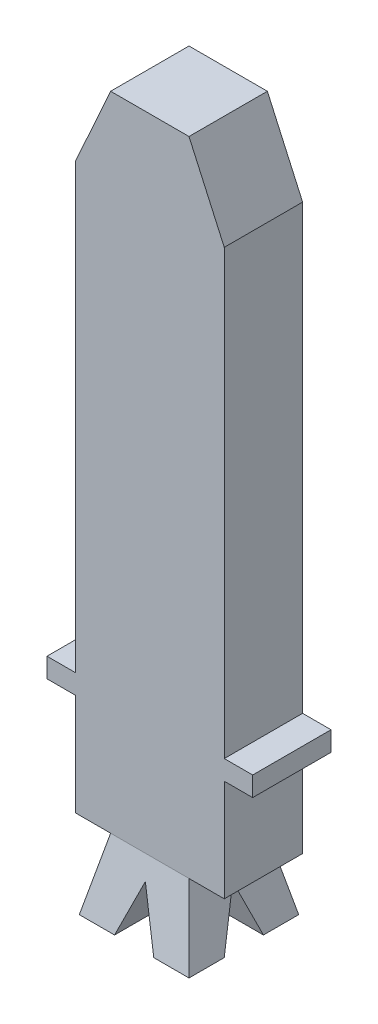
ISO-10303-21;
HEADER;
FILE_DESCRIPTION(('STEP AP214'),'2;1');
FILE_NAME('part.step','',(''),(''),'','','');
FILE_SCHEMA(('AUTOMOTIVE_DESIGN { 1 0 10303 214 1 1 1 1 }'));
ENDSEC;
DATA;
#1=APPLICATION_CONTEXT('core data for automotive mechanical design processes');
#2=APPLICATION_PROTOCOL_DEFINITION('international standard','automotive_design',2000,#1);
#3=PRODUCT_CONTEXT('',#1,'mechanical');
#4=PRODUCT('Part','Part','',(#3));
#5=PRODUCT_RELATED_PRODUCT_CATEGORY('part','',(#4));
#6=PRODUCT_DEFINITION_FORMATION('','',#4);
#7=PRODUCT_DEFINITION_CONTEXT('part definition',#1,'design');
#8=PRODUCT_DEFINITION('design','',#6,#7);
#9=PRODUCT_DEFINITION_SHAPE('','',#8);
#10=(LENGTH_UNIT() NAMED_UNIT(*) SI_UNIT(.MILLI.,.METRE.));
#11=(NAMED_UNIT(*) PLANE_ANGLE_UNIT() SI_UNIT($,.RADIAN.));
#12=(NAMED_UNIT(*) SI_UNIT($,.STERADIAN.) SOLID_ANGLE_UNIT());
#13=UNCERTAINTY_MEASURE_WITH_UNIT(LENGTH_MEASURE(1.E-05),#10,'distance_accuracy_value','');
#14=(GEOMETRIC_REPRESENTATION_CONTEXT(3) GLOBAL_UNCERTAINTY_ASSIGNED_CONTEXT((#13)) GLOBAL_UNIT_ASSIGNED_CONTEXT((#10,
#11,#12)) REPRESENTATION_CONTEXT('',''));
#15=CARTESIAN_POINT('',(0.,0.,0.));
#16=DIRECTION('',(0.,0.,1.));
#17=DIRECTION('',(1.,0.,0.));
#18=AXIS2_PLACEMENT_3D('',#15,#16,#17);
#19=CARTESIAN_POINT('',(0.,-4.9,0.));
#20=DIRECTION('',(0.,-1.,0.));
#21=DIRECTION('',(0.,0.,-1.));
#22=AXIS2_PLACEMENT_3D('',#19,#20,#21);
#23=PLANE('',#22);
#24=DIRECTION('',(-1.,0.,0.));
#25=VECTOR('',#24,1.);
#26=CARTESIAN_POINT('',(2.625,-4.9,1.5));
#27=LINE('',#26,#25);
#28=CARTESIAN_POINT('',(1.4,-4.9,1.5));
#29=VERTEX_POINT('',#28);
#30=CARTESIAN_POINT('',(0.5,-4.9,1.5));
#31=VERTEX_POINT('',#30);
#32=EDGE_CURVE('E480',#29,#31,#27,.T.);
#33=ORIENTED_EDGE('',*,*,#32,.F.);
#34=DIRECTION('',(0.,0.,1.));
#35=VECTOR('',#34,1.);
#36=CARTESIAN_POINT('',(1.4,-4.9,-0.4));
#37=LINE('',#36,#35);
#38=CARTESIAN_POINT('',(1.4,-4.9,2.4));
#39=VERTEX_POINT('',#38);
#40=EDGE_CURVE('E182',#29,#39,#37,.T.);
#41=ORIENTED_EDGE('',*,*,#40,.T.);
#42=DIRECTION('',(-1.,0.,0.));
#43=VECTOR('',#42,1.);
#44=CARTESIAN_POINT('',(1.4,-4.9,2.4));
#45=LINE('',#44,#43);
#46=CARTESIAN_POINT('',(0.500000000000001,-4.9,2.4));
#47=VERTEX_POINT('',#46);
#48=EDGE_CURVE('E357',#39,#47,#45,.T.);
#49=ORIENTED_EDGE('',*,*,#48,.T.);
#50=DIRECTION('',(0.,0.,1.));
#51=VECTOR('',#50,1.);
#52=CARTESIAN_POINT('',(0.500000000000001,-4.9,-0.4001));
#53=LINE('',#52,#51);
#54=EDGE_CURVE('E328',#31,#47,#53,.T.);
#55=ORIENTED_EDGE('',*,*,#54,.F.);
#56=EDGE_LOOP('',(#33,#41,#49,#55));
#57=FACE_BOUND('',#56,.T.);
#58=ADVANCED_FACE('F54',(#57),#23,.T.);
#59=CARTESIAN_POINT('',(-0.499999999999999,-4.9,1.5));
#60=VERTEX_POINT('',#59);
#61=CARTESIAN_POINT('',(-1.4,-4.9,1.5));
#62=VERTEX_POINT('',#61);
#63=EDGE_CURVE('E161',#60,#62,#27,.T.);
#64=ORIENTED_EDGE('',*,*,#63,.F.);
#65=DIRECTION('',(0.,0.,1.));
#66=VECTOR('',#65,1.);
#67=CARTESIAN_POINT('',(-0.499999999999999,-4.9,-0.4001));
#68=LINE('',#67,#66);
#69=CARTESIAN_POINT('',(-0.499999999999999,-4.9,2.4));
#70=VERTEX_POINT('',#69);
#71=EDGE_CURVE('E361',#60,#70,#68,.T.);
#72=ORIENTED_EDGE('',*,*,#71,.T.);
#73=CARTESIAN_POINT('',(-1.4,-4.9,2.4));
#74=VERTEX_POINT('',#73);
#75=EDGE_CURVE('E181',#70,#74,#45,.T.);
#76=ORIENTED_EDGE('',*,*,#75,.T.);
#77=DIRECTION('',(0.,0.,-1.));
#78=VECTOR('',#77,1.);
#79=CARTESIAN_POINT('',(-1.4,-4.9,-0.4));
#80=LINE('',#79,#78);
#81=EDGE_CURVE('E391',#74,#62,#80,.T.);
#82=ORIENTED_EDGE('',*,*,#81,.T.);
#83=EDGE_LOOP('',(#64,#72,#76,#82));
#84=FACE_BOUND('',#83,.T.);
#85=ADVANCED_FACE('F520',(#84),#23,.T.);
#86=CARTESIAN_POINT('',(0.500000000000001,-4.9,-0.4001));
#87=DIRECTION('',(0.932267960991806,0.361768501818747,0.));
#88=DIRECTION('',(-0.361768501818747,0.932267960991806,0.));
#89=AXIS2_PLACEMENT_3D('',#86,#87,#88);
#90=PLANE('',#89);
#91=DIRECTION('',(0.,0.,1.));
#92=VECTOR('',#91,1.);
#93=CARTESIAN_POINT('',(0.,-3.61151308598601,-0.4001));
#94=LINE('',#93,#92);
#95=CARTESIAN_POINT('',(0.,-3.611513085986,0.999999999999999));
#96=VERTEX_POINT('',#95);
#97=CARTESIAN_POINT('',(0.,-3.611513085986,2.11366957466356));
#98=VERTEX_POINT('',#97);
#99=EDGE_CURVE('E474',#96,#98,#94,.T.);
#100=ORIENTED_EDGE('',*,*,#99,.F.);
#101=DIRECTION('',(0.340191275432694,-0.876664013313512,0.340191275432694));
#102=VECTOR('',#101,1.);
#103=CARTESIAN_POINT('',(0.280101229616619,-4.33332662390649,1.28010122961662));
#104=LINE('',#103,#102);
#105=EDGE_CURVE('E173',#96,#31,#104,.T.);
#106=ORIENTED_EDGE('',*,*,#105,.T.);
#107=ORIENTED_EDGE('',*,*,#54,.T.);
#108=DIRECTION('',(0.354246297399246,-0.912883437073675,0.202862986016372));
#109=VECTOR('',#108,1.);
#110=CARTESIAN_POINT('',(-1.3198068575803,-0.210405355949719,1.35786785687772));
#111=LINE('',#110,#109);
#112=EDGE_CURVE('E321',#98,#47,#111,.T.);
#113=ORIENTED_EDGE('',*,*,#112,.F.);
#114=EDGE_LOOP('',(#100,#106,#107,#113));
#115=FACE_BOUND('',#114,.T.);
#116=ADVANCED_FACE('F477',(#115),#90,.F.);
#117=CARTESIAN_POINT('',(0.,-3.61151308598601,-0.4001));
#118=DIRECTION('',(-0.932267960991806,0.361768501818746,0.));
#119=DIRECTION('',(-0.361768501818746,-0.932267960991806,0.));
#120=AXIS2_PLACEMENT_3D('',#117,#118,#119);
#121=PLANE('',#120);
#122=ORIENTED_EDGE('',*,*,#71,.F.);
#123=DIRECTION('',(0.340191275432693,0.876664013313513,-0.340191275432694));
#124=VECTOR('',#123,1.);
#125=CARTESIAN_POINT('',(0.16203371844312,-3.19395643430003,0.837966281556879));
#126=LINE('',#125,#124);
#127=EDGE_CURVE('E13',#60,#96,#126,.T.);
#128=ORIENTED_EDGE('',*,*,#127,.T.);
#129=ORIENTED_EDGE('',*,*,#99,.T.);
#130=DIRECTION('',(0.354246297399245,0.912883437073675,-0.202862986016372));
#131=VECTOR('',#130,1.);
#132=CARTESIAN_POINT('',(1.3198068575803,-0.210405355949717,1.35786785687771));
#133=LINE('',#132,#131);
#134=EDGE_CURVE('E324',#70,#98,#133,.T.);
#135=ORIENTED_EDGE('',*,*,#134,.F.);
#136=EDGE_LOOP('',(#122,#128,#129,#135));
#137=FACE_BOUND('',#136,.T.);
#138=ADVANCED_FACE('F472',(#137),#121,.F.);
#139=DIRECTION('',(-1.,0.,0.));
#140=VECTOR('',#139,1.);
#141=CARTESIAN_POINT('',(2.625,-4.9,0.499999999999999));
#142=LINE('',#141,#140);
#143=CARTESIAN_POINT('',(1.4,-4.9,0.499999999999999));
#144=VERTEX_POINT('',#143);
#145=CARTESIAN_POINT('',(0.5,-4.9,0.499999999999999));
#146=VERTEX_POINT('',#145);
#147=EDGE_CURVE('E150',#144,#146,#142,.T.);
#148=ORIENTED_EDGE('',*,*,#147,.T.);
#149=CARTESIAN_POINT('',(0.500000000000001,-4.9,-0.4));
#150=VERTEX_POINT('',#149);
#151=EDGE_CURVE('E325',#150,#146,#53,.T.);
#152=ORIENTED_EDGE('',*,*,#151,.F.);
#153=DIRECTION('',(1.,0.,0.));
#154=VECTOR('',#153,1.);
#155=CARTESIAN_POINT('',(1.4,-4.9,-0.4));
#156=LINE('',#155,#154);
#157=CARTESIAN_POINT('',(1.4,-4.9,-0.4));
#158=VERTEX_POINT('',#157);
#159=EDGE_CURVE('E179',#150,#158,#156,.T.);
#160=ORIENTED_EDGE('',*,*,#159,.T.);
#161=EDGE_CURVE('E169',#158,#144,#37,.T.);
#162=ORIENTED_EDGE('',*,*,#161,.T.);
#163=EDGE_LOOP('',(#148,#152,#160,#162));
#164=FACE_BOUND('',#163,.T.);
#165=ADVANCED_FACE('F177',(#164),#23,.T.);
#166=CARTESIAN_POINT('',(-0.499999999999999,-4.9,0.499999999999999));
#167=VERTEX_POINT('',#166);
#168=CARTESIAN_POINT('',(-1.4,-4.9,0.499999999999999));
#169=VERTEX_POINT('',#168);
#170=EDGE_CURVE('E73',#167,#169,#142,.T.);
#171=ORIENTED_EDGE('',*,*,#170,.T.);
#172=CARTESIAN_POINT('',(-1.4,-4.9,-0.4));
#173=VERTEX_POINT('',#172);
#174=EDGE_CURVE('E59',#169,#173,#80,.T.);
#175=ORIENTED_EDGE('',*,*,#174,.T.);
#176=CARTESIAN_POINT('',(-0.499999999999999,-4.9,-0.4));
#177=VERTEX_POINT('',#176);
#178=EDGE_CURVE('E251',#173,#177,#156,.T.);
#179=ORIENTED_EDGE('',*,*,#178,.T.);
#180=EDGE_CURVE('E80',#177,#167,#68,.T.);
#181=ORIENTED_EDGE('',*,*,#180,.T.);
#182=EDGE_LOOP('',(#171,#175,#179,#181));
#183=FACE_BOUND('',#182,.T.);
#184=ADVANCED_FACE('F56',(#183),#23,.T.);
#185=CARTESIAN_POINT('',(0.,-3.1,0.));
#186=DIRECTION('',(0.,-1.,0.));
#187=DIRECTION('',(0.,0.,-1.));
#188=AXIS2_PLACEMENT_3D('',#185,#186,#187);
#189=PLANE('',#188);
#190=DIRECTION('',(0.,0.,-1.));
#191=VECTOR('',#190,1.);
#192=CARTESIAN_POINT('',(-1.,-3.1,2.));
#193=LINE('',#192,#191);
#194=CARTESIAN_POINT('',(-1.,-3.1,2.));
#195=VERTEX_POINT('',#194);
#196=CARTESIAN_POINT('',(-1.,-3.1,0.));
#197=VERTEX_POINT('',#196);
#198=EDGE_CURVE('E299',#195,#197,#193,.T.);
#199=ORIENTED_EDGE('',*,*,#198,.F.);
#200=DIRECTION('',(-1.,0.,0.));
#201=VECTOR('',#200,1.);
#202=CARTESIAN_POINT('',(-1.,-3.1,2.));
#203=LINE('',#202,#201);
#204=CARTESIAN_POINT('',(1.,-3.1,2.));
#205=VERTEX_POINT('',#204);
#206=EDGE_CURVE('E304',#205,#195,#203,.T.);
#207=ORIENTED_EDGE('',*,*,#206,.F.);
#208=DIRECTION('',(0.,0.,1.));
#209=VECTOR('',#208,1.);
#210=CARTESIAN_POINT('',(1.,-3.1,2.));
#211=LINE('',#210,#209);
#212=CARTESIAN_POINT('',(1.,-3.1,0.));
#213=VERTEX_POINT('',#212);
#214=EDGE_CURVE('E407',#213,#205,#211,.T.);
#215=ORIENTED_EDGE('',*,*,#214,.F.);
#216=DIRECTION('',(1.,0.,0.));
#217=VECTOR('',#216,1.);
#218=CARTESIAN_POINT('',(-1.,-3.1,0.));
#219=LINE('',#218,#217);
#220=EDGE_CURVE('E439',#197,#213,#219,.T.);
#221=ORIENTED_EDGE('',*,*,#220,.F.);
#222=EDGE_LOOP('',(#199,#207,#215,#221));
#223=FACE_BOUND('',#222,.T.);
#224=ADVANCED_FACE('F417',(#223),#189,.F.);
#225=CARTESIAN_POINT('',(0.,0.277647058823529,1.24941176470588));
#226=DIRECTION('',(0.,-0.216930457818656,-0.976187060183953));
#227=DIRECTION('',(0.,0.976187060183953,-0.216930457818656));
#228=AXIS2_PLACEMENT_3D('',#225,#226,#227);
#229=PLANE('',#228);
#230=ORIENTED_EDGE('',*,*,#134,.T.);
#231=ORIENTED_EDGE('',*,*,#112,.T.);
#232=ORIENTED_EDGE('',*,*,#48,.F.);
#233=DIRECTION('',(0.211999576001272,-0.953998092005724,0.211999576001272));
#234=VECTOR('',#233,1.);
#235=CARTESIAN_POINT('',(1.,-3.1,2.));
#236=LINE('',#235,#234);
#237=EDGE_CURVE('E281',#205,#39,#236,.T.);
#238=ORIENTED_EDGE('',*,*,#237,.F.);
#239=ORIENTED_EDGE('',*,*,#206,.T.);
#240=DIRECTION('',(-0.211999576001272,-0.953998092005724,0.211999576001272));
#241=VECTOR('',#240,1.);
#242=CARTESIAN_POINT('',(-1.,-3.1,2.));
#243=LINE('',#242,#241);
#244=EDGE_CURVE('E285',#195,#74,#243,.T.);
#245=ORIENTED_EDGE('',*,*,#244,.T.);
#246=ORIENTED_EDGE('',*,*,#75,.F.);
#247=EDGE_LOOP('',(#230,#231,#232,#238,#239,#245,#246));
#248=FACE_BOUND('',#247,.T.);
#249=ADVANCED_FACE('F230',(#248),#229,.F.);
#250=CARTESIAN_POINT('',(0.296470588235295,0.0658823529411766,0.));
#251=DIRECTION('',(-0.976187060183953,-0.216930457818656,0.));
#252=DIRECTION('',(0.216930457818656,-0.976187060183953,0.));
#253=AXIS2_PLACEMENT_3D('',#250,#251,#252);
#254=PLANE('',#253);
#255=ORIENTED_EDGE('',*,*,#40,.F.);
#256=DIRECTION('',(-0.202862986016372,0.912883437073675,-0.354246297399246));
#257=VECTOR('',#256,1.);
#258=CARTESIAN_POINT('',(0.32715778629754,-0.0722100383389264,-0.373433835125718));
#259=LINE('',#258,#257);
#260=CARTESIAN_POINT('',(1.11366957466356,-3.611513085986,0.999999999999998));
#261=VERTEX_POINT('',#260);
#262=EDGE_CURVE('E172',#29,#261,#259,.T.);
#263=ORIENTED_EDGE('',*,*,#262,.T.);
#264=DIRECTION('',(0.202862986016372,-0.912883437073675,-0.354246297399245));
#265=VECTOR('',#264,1.);
#266=CARTESIAN_POINT('',(0.470884709648849,-0.718981193419817,2.12245295668356));
#267=LINE('',#266,#265);
#268=EDGE_CURVE('E153',#261,#144,#267,.T.);
#269=ORIENTED_EDGE('',*,*,#268,.T.);
#270=ORIENTED_EDGE('',*,*,#161,.F.);
#271=DIRECTION('',(0.211999576001272,-0.953998092005724,-0.211999576001272));
#272=VECTOR('',#271,1.);
#273=CARTESIAN_POINT('',(1.,-3.1,0.));
#274=LINE('',#273,#272);
#275=EDGE_CURVE('E272',#213,#158,#274,.T.);
#276=ORIENTED_EDGE('',*,*,#275,.F.);
#277=ORIENTED_EDGE('',*,*,#214,.T.);
#278=ORIENTED_EDGE('',*,*,#237,.T.);
#279=EDGE_LOOP('',(#255,#263,#269,#270,#276,#277,#278));
#280=FACE_BOUND('',#279,.T.);
#281=ADVANCED_FACE('F167',(#280),#254,.F.);
#282=CARTESIAN_POINT('',(-0.296470588235294,0.0658823529411765,0.));
#283=DIRECTION('',(0.976187060183953,-0.216930457818656,0.));
#284=DIRECTION('',(0.216930457818656,0.976187060183953,0.));
#285=AXIS2_PLACEMENT_3D('',#282,#283,#284);
#286=PLANE('',#285);
#287=DIRECTION('',(0.202862986016372,0.912883437073675,0.354246297399245));
#288=VECTOR('',#287,1.);
#289=CARTESIAN_POINT('',(-0.470884709648848,-0.718981193419817,2.12245295668357));
#290=LINE('',#289,#288);
#291=CARTESIAN_POINT('',(-1.11366957466356,-3.611513085986,0.999999999999999));
#292=VERTEX_POINT('',#291);
#293=EDGE_CURVE('E174',#169,#292,#290,.T.);
#294=ORIENTED_EDGE('',*,*,#293,.T.);
#295=DIRECTION('',(-0.202862986016372,-0.912883437073675,0.354246297399246));
#296=VECTOR('',#295,1.);
#297=CARTESIAN_POINT('',(-0.327157786297539,-0.0722100383389265,-0.373433835125718));
#298=LINE('',#297,#296);
#299=EDGE_CURVE('E502',#292,#62,#298,.T.);
#300=ORIENTED_EDGE('',*,*,#299,.T.);
#301=ORIENTED_EDGE('',*,*,#81,.F.);
#302=ORIENTED_EDGE('',*,*,#244,.F.);
#303=ORIENTED_EDGE('',*,*,#198,.T.);
#304=DIRECTION('',(-0.211999576001272,-0.953998092005724,-0.211999576001272));
#305=VECTOR('',#304,1.);
#306=CARTESIAN_POINT('',(-1.,-3.1,0.));
#307=LINE('',#306,#305);
#308=EDGE_CURVE('E278',#197,#173,#307,.T.);
#309=ORIENTED_EDGE('',*,*,#308,.T.);
#310=ORIENTED_EDGE('',*,*,#174,.F.);
#311=EDGE_LOOP('',(#294,#300,#301,#302,#303,#309,#310));
#312=FACE_BOUND('',#311,.T.);
#313=ADVANCED_FACE('F229',(#312),#286,.F.);
#314=CARTESIAN_POINT('',(0.,-0.145882352941177,0.656470588235294));
#315=DIRECTION('',(0.,-0.216930457818656,0.976187060183953));
#316=DIRECTION('',(0.,-0.976187060183953,-0.216930457818656));
#317=AXIS2_PLACEMENT_3D('',#314,#315,#316);
#318=PLANE('',#317);
#319=ORIENTED_EDGE('',*,*,#159,.F.);
#320=DIRECTION('',(-0.354246297399246,0.912883437073675,0.202862986016372));
#321=VECTOR('',#320,1.);
#322=CARTESIAN_POINT('',(-1.17607993422899,-0.580785875809028,0.559825360931327));
#323=LINE('',#322,#321);
#324=CARTESIAN_POINT('',(0.,-3.611513085986,-0.113669574663557));
#325=VERTEX_POINT('',#324);
#326=EDGE_CURVE('E363',#150,#325,#323,.T.);
#327=ORIENTED_EDGE('',*,*,#326,.T.);
#328=DIRECTION('',(-0.354246297399245,-0.912883437073675,-0.202862986016372));
#329=VECTOR('',#328,1.);
#330=CARTESIAN_POINT('',(1.17607993422899,-0.580785875809026,0.559825360931328));
#331=LINE('',#330,#329);
#332=EDGE_CURVE('E366',#325,#177,#331,.T.);
#333=ORIENTED_EDGE('',*,*,#332,.T.);
#334=ORIENTED_EDGE('',*,*,#178,.F.);
#335=ORIENTED_EDGE('',*,*,#308,.F.);
#336=ORIENTED_EDGE('',*,*,#220,.T.);
#337=ORIENTED_EDGE('',*,*,#275,.T.);
#338=EDGE_LOOP('',(#319,#327,#333,#334,#335,#336,#337));
#339=FACE_BOUND('',#338,.T.);
#340=ADVANCED_FACE('F255',(#339),#318,.F.);
#341=ORIENTED_EDGE('',*,*,#151,.T.);
#342=DIRECTION('',(-0.340191275432694,0.876664013313513,0.340191275432693));
#343=VECTOR('',#342,1.);
#344=CARTESIAN_POINT('',(0.604168666502859,-5.16843992727844,0.395831333497141));
#345=LINE('',#344,#343);
#346=EDGE_CURVE('E156',#146,#96,#345,.T.);
#347=ORIENTED_EDGE('',*,*,#346,.T.);
#348=EDGE_CURVE('E362',#325,#96,#94,.T.);
#349=ORIENTED_EDGE('',*,*,#348,.F.);
#350=ORIENTED_EDGE('',*,*,#326,.F.);
#351=EDGE_LOOP('',(#341,#347,#349,#350));
#352=FACE_BOUND('',#351,.T.);
#353=ADVANCED_FACE('F263',(#352),#90,.F.);
#354=ORIENTED_EDGE('',*,*,#348,.T.);
#355=DIRECTION('',(-0.340191275432693,-0.876664013313513,-0.340191275432693));
#356=VECTOR('',#355,1.);
#357=CARTESIAN_POINT('',(-0.16203371844312,-4.02906973767198,0.837966281556879));
#358=LINE('',#357,#356);
#359=EDGE_CURVE('E65',#96,#167,#358,.T.);
#360=ORIENTED_EDGE('',*,*,#359,.T.);
#361=ORIENTED_EDGE('',*,*,#180,.F.);
#362=ORIENTED_EDGE('',*,*,#332,.F.);
#363=EDGE_LOOP('',(#354,#360,#361,#362));
#364=FACE_BOUND('',#363,.T.);
#365=ADVANCED_FACE('F531',(#364),#121,.F.);
#366=CARTESIAN_POINT('',(2.625,-3.611513085986,0.999999999999999));
#367=DIRECTION('',(0.,0.361768501818746,-0.932267960991806));
#368=DIRECTION('',(0.,0.932267960991806,0.361768501818746));
#369=AXIS2_PLACEMENT_3D('',#366,#367,#368);
#370=PLANE('',#369);
#371=ORIENTED_EDGE('',*,*,#170,.F.);
#372=ORIENTED_EDGE('',*,*,#359,.F.);
#373=DIRECTION('',(-1.,0.,0.));
#374=VECTOR('',#373,1.);
#375=CARTESIAN_POINT('',(2.625,-3.611513085986,0.999999999999999));
#376=LINE('',#375,#374);
#377=EDGE_CURVE('E494',#96,#292,#376,.T.);
#378=ORIENTED_EDGE('',*,*,#377,.T.);
#379=ORIENTED_EDGE('',*,*,#293,.F.);
#380=EDGE_LOOP('',(#371,#372,#378,#379));
#381=FACE_BOUND('',#380,.T.);
#382=ADVANCED_FACE('F504',(#381),#370,.F.);
#383=CARTESIAN_POINT('',(2.625,-4.9,1.5));
#384=DIRECTION('',(0.,0.361768501818747,0.932267960991806));
#385=DIRECTION('',(0.,-0.932267960991806,0.361768501818747));
#386=AXIS2_PLACEMENT_3D('',#383,#384,#385);
#387=PLANE('',#386);
#388=ORIENTED_EDGE('',*,*,#377,.F.);
#389=ORIENTED_EDGE('',*,*,#127,.F.);
#390=ORIENTED_EDGE('',*,*,#63,.T.);
#391=ORIENTED_EDGE('',*,*,#299,.F.);
#392=EDGE_LOOP('',(#388,#389,#390,#391));
#393=FACE_BOUND('',#392,.T.);
#394=ADVANCED_FACE('F512',(#393),#387,.F.);
#395=ORIENTED_EDGE('',*,*,#32,.T.);
#396=ORIENTED_EDGE('',*,*,#105,.F.);
#397=EDGE_CURVE('E497',#261,#96,#376,.T.);
#398=ORIENTED_EDGE('',*,*,#397,.F.);
#399=ORIENTED_EDGE('',*,*,#262,.F.);
#400=EDGE_LOOP('',(#395,#396,#398,#399));
#401=FACE_BOUND('',#400,.T.);
#402=ADVANCED_FACE('F507',(#401),#387,.F.);
#403=ORIENTED_EDGE('',*,*,#397,.T.);
#404=ORIENTED_EDGE('',*,*,#346,.F.);
#405=ORIENTED_EDGE('',*,*,#147,.F.);
#406=ORIENTED_EDGE('',*,*,#268,.F.);
#407=EDGE_LOOP('',(#403,#404,#405,#406));
#408=FACE_BOUND('',#407,.T.);
#409=ADVANCED_FACE('F152',(#408),#370,.F.);
#410=CLOSED_SHELL('',(#58,#85,#116,#138,#165,#184,#224,#249,#281,#313,#340,#353,#365,#382,#394,
#402,#409));
#411=MANIFOLD_SOLID_BREP('B2',#410);
#412=CARTESIAN_POINT('',(-1.9,11.3,2.));
#413=DIRECTION('',(0.911921505175107,-0.410364677328798,0.));
#414=DIRECTION('',(0.410364677328798,0.911921505175107,0.));
#415=AXIS2_PLACEMENT_3D('',#412,#413,#414);
#416=PLANE('',#415);
#417=DIRECTION('',(-0.410364677328798,-0.911921505175106,0.));
#418=VECTOR('',#417,1.);
#419=CARTESIAN_POINT('',(-1.9,11.3,0.));
#420=LINE('',#419,#418);
#421=CARTESIAN_POINT('',(-1.,13.3,0.));
#422=VERTEX_POINT('',#421);
#423=CARTESIAN_POINT('',(-1.9,11.3,0.));
#424=VERTEX_POINT('',#423);
#425=EDGE_CURVE('E804',#422,#424,#420,.T.);
#426=ORIENTED_EDGE('',*,*,#425,.T.);
#427=DIRECTION('',(0.,0.,-1.));
#428=VECTOR('',#427,1.);
#429=CARTESIAN_POINT('',(-1.9,11.3,2.));
#430=LINE('',#429,#428);
#431=CARTESIAN_POINT('',(-1.9,11.3,2.));
#432=VERTEX_POINT('',#431);
#433=EDGE_CURVE('E52',#432,#424,#430,.T.);
#434=ORIENTED_EDGE('',*,*,#433,.F.);
#435=DIRECTION('',(-0.410364677328798,-0.911921505175106,0.));
#436=VECTOR('',#435,1.);
#437=CARTESIAN_POINT('',(-1.9,11.3,2.));
#438=LINE('',#437,#436);
#439=CARTESIAN_POINT('',(-1.,13.3,2.));
#440=VERTEX_POINT('',#439);
#441=EDGE_CURVE('E830',#440,#432,#438,.T.);
#442=ORIENTED_EDGE('',*,*,#441,.F.);
#443=DIRECTION('',(0.,0.,-1.));
#444=VECTOR('',#443,1.);
#445=CARTESIAN_POINT('',(-1.,13.3,2.));
#446=LINE('',#445,#444);
#447=EDGE_CURVE('E800',#440,#422,#446,.T.);
#448=ORIENTED_EDGE('',*,*,#447,.T.);
#449=EDGE_LOOP('',(#426,#434,#442,#448));
#450=FACE_BOUND('',#449,.T.);
#451=ADVANCED_FACE('F672',(#450),#416,.F.);
#452=CARTESIAN_POINT('',(-1.9,11.3,2.));
#453=DIRECTION('',(1.,0.,0.));
#454=DIRECTION('',(0.,1.,0.));
#455=AXIS2_PLACEMENT_3D('',#452,#453,#454);
#456=PLANE('',#455);
#457=DIRECTION('',(0.,-1.,0.));
#458=VECTOR('',#457,1.);
#459=CARTESIAN_POINT('',(-1.9,11.3,0.));
#460=LINE('',#459,#458);
#461=CARTESIAN_POINT('',(-1.9,0.,0.));
#462=VERTEX_POINT('',#461);
#463=EDGE_CURVE('E807',#424,#462,#460,.T.);
#464=ORIENTED_EDGE('',*,*,#463,.T.);
#465=DIRECTION('',(0.,0.,-1.));
#466=VECTOR('',#465,1.);
#467=CARTESIAN_POINT('',(-1.9,0.,2.));
#468=LINE('',#467,#466);
#469=CARTESIAN_POINT('',(-1.9,0.,2.));
#470=VERTEX_POINT('',#469);
#471=EDGE_CURVE('E680',#470,#462,#468,.T.);
#472=ORIENTED_EDGE('',*,*,#471,.F.);
#473=DIRECTION('',(0.,-1.,0.));
#474=VECTOR('',#473,1.);
#475=CARTESIAN_POINT('',(-1.9,11.3,2.));
#476=LINE('',#475,#474);
#477=EDGE_CURVE('E749',#432,#470,#476,.T.);
#478=ORIENTED_EDGE('',*,*,#477,.F.);
#479=ORIENTED_EDGE('',*,*,#433,.T.);
#480=EDGE_LOOP('',(#464,#472,#478,#479));
#481=FACE_BOUND('',#480,.T.);
#482=ADVANCED_FACE('F918',(#481),#456,.F.);
#483=CARTESIAN_POINT('',(-2.625,0.,2.));
#484=DIRECTION('',(0.,-1.,0.));
#485=DIRECTION('',(1.,0.,0.));
#486=AXIS2_PLACEMENT_3D('',#483,#484,#485);
#487=PLANE('',#486);
#488=DIRECTION('',(-1.,0.,0.));
#489=VECTOR('',#488,1.);
#490=CARTESIAN_POINT('',(-2.625,0.,0.));
#491=LINE('',#490,#489);
#492=CARTESIAN_POINT('',(-2.625,0.,0.));
#493=VERTEX_POINT('',#492);
#494=EDGE_CURVE('E809',#462,#493,#491,.T.);
#495=ORIENTED_EDGE('',*,*,#494,.T.);
#496=DIRECTION('',(0.,0.,-1.));
#497=VECTOR('',#496,1.);
#498=CARTESIAN_POINT('',(-2.625,0.,2.));
#499=LINE('',#498,#497);
#500=CARTESIAN_POINT('',(-2.625,0.,2.));
#501=VERTEX_POINT('',#500);
#502=EDGE_CURVE('E855',#501,#493,#499,.T.);
#503=ORIENTED_EDGE('',*,*,#502,.F.);
#504=DIRECTION('',(-1.,0.,0.));
#505=VECTOR('',#504,1.);
#506=CARTESIAN_POINT('',(-2.625,0.,2.));
#507=LINE('',#506,#505);
#508=EDGE_CURVE('E863',#470,#501,#507,.T.);
#509=ORIENTED_EDGE('',*,*,#508,.F.);
#510=ORIENTED_EDGE('',*,*,#471,.T.);
#511=EDGE_LOOP('',(#495,#503,#509,#510));
#512=FACE_BOUND('',#511,.T.);
#513=ADVANCED_FACE('F861',(#512),#487,.F.);
#514=CARTESIAN_POINT('',(-2.625,0.,2.));
#515=DIRECTION('',(1.,0.,0.));
#516=DIRECTION('',(0.,0.,-1.));
#517=AXIS2_PLACEMENT_3D('',#514,#515,#516);
#518=PLANE('',#517);
#519=DIRECTION('',(0.,-1.,0.));
#520=VECTOR('',#519,1.);
#521=CARTESIAN_POINT('',(-2.625,0.,0.));
#522=LINE('',#521,#520);
#523=CARTESIAN_POINT('',(-2.625,-0.5,0.));
#524=VERTEX_POINT('',#523);
#525=EDGE_CURVE('E811',#493,#524,#522,.T.);
#526=ORIENTED_EDGE('',*,*,#525,.T.);
#527=DIRECTION('',(0.,0.,-1.));
#528=VECTOR('',#527,1.);
#529=CARTESIAN_POINT('',(-2.625,-0.5,2.));
#530=LINE('',#529,#528);
#531=CARTESIAN_POINT('',(-2.625,-0.5,2.));
#532=VERTEX_POINT('',#531);
#533=EDGE_CURVE('E852',#532,#524,#530,.T.);
#534=ORIENTED_EDGE('',*,*,#533,.F.);
#535=DIRECTION('',(0.,-1.,0.));
#536=VECTOR('',#535,1.);
#537=CARTESIAN_POINT('',(-2.625,0.,2.));
#538=LINE('',#537,#536);
#539=EDGE_CURVE('E881',#501,#532,#538,.T.);
#540=ORIENTED_EDGE('',*,*,#539,.F.);
#541=ORIENTED_EDGE('',*,*,#502,.T.);
#542=EDGE_LOOP('',(#526,#534,#540,#541));
#543=FACE_BOUND('',#542,.T.);
#544=ADVANCED_FACE('F872',(#543),#518,.F.);
#545=CARTESIAN_POINT('',(-2.625,-0.5,2.));
#546=DIRECTION('',(0.,1.,0.));
#547=DIRECTION('',(0.,0.,1.));
#548=AXIS2_PLACEMENT_3D('',#545,#546,#547);
#549=PLANE('',#548);
#550=DIRECTION('',(1.,0.,0.));
#551=VECTOR('',#550,1.);
#552=CARTESIAN_POINT('',(-2.625,-0.5,0.));
#553=LINE('',#552,#551);
#554=CARTESIAN_POINT('',(-1.9,-0.5,0.));
#555=VERTEX_POINT('',#554);
#556=EDGE_CURVE('E813',#524,#555,#553,.T.);
#557=ORIENTED_EDGE('',*,*,#556,.T.);
#558=DIRECTION('',(0.,0.,-1.));
#559=VECTOR('',#558,1.);
#560=CARTESIAN_POINT('',(-1.9,-0.5,2.));
#561=LINE('',#560,#559);
#562=CARTESIAN_POINT('',(-1.9,-0.5,2.));
#563=VERTEX_POINT('',#562);
#564=EDGE_CURVE('E849',#563,#555,#561,.T.);
#565=ORIENTED_EDGE('',*,*,#564,.F.);
#566=DIRECTION('',(1.,0.,0.));
#567=VECTOR('',#566,1.);
#568=CARTESIAN_POINT('',(-2.625,-0.5,2.));
#569=LINE('',#568,#567);
#570=EDGE_CURVE('E878',#532,#563,#569,.T.);
#571=ORIENTED_EDGE('',*,*,#570,.F.);
#572=ORIENTED_EDGE('',*,*,#533,.T.);
#573=EDGE_LOOP('',(#557,#565,#571,#572));
#574=FACE_BOUND('',#573,.T.);
#575=ADVANCED_FACE('F876',(#574),#549,.F.);
#576=CARTESIAN_POINT('',(-1.9,-0.5,2.));
#577=DIRECTION('',(1.,0.,0.));
#578=DIRECTION('',(0.,1.,0.));
#579=AXIS2_PLACEMENT_3D('',#576,#577,#578);
#580=PLANE('',#579);
#581=DIRECTION('',(0.,-1.,0.));
#582=VECTOR('',#581,1.);
#583=CARTESIAN_POINT('',(-1.9,-0.5,0.));
#584=LINE('',#583,#582);
#585=CARTESIAN_POINT('',(-1.9,-3.1,0.));
#586=VERTEX_POINT('',#585);
#587=EDGE_CURVE('E815',#555,#586,#584,.T.);
#588=ORIENTED_EDGE('',*,*,#587,.T.);
#589=DIRECTION('',(0.,0.,-1.));
#590=VECTOR('',#589,1.);
#591=CARTESIAN_POINT('',(-1.9,-3.1,2.));
#592=LINE('',#591,#590);
#593=CARTESIAN_POINT('',(-1.9,-3.1,2.));
#594=VERTEX_POINT('',#593);
#595=EDGE_CURVE('E846',#594,#586,#592,.T.);
#596=ORIENTED_EDGE('',*,*,#595,.F.);
#597=DIRECTION('',(0.,-1.,0.));
#598=VECTOR('',#597,1.);
#599=CARTESIAN_POINT('',(-1.9,-0.5,2.));
#600=LINE('',#599,#598);
#601=EDGE_CURVE('E880',#563,#594,#600,.T.);
#602=ORIENTED_EDGE('',*,*,#601,.F.);
#603=ORIENTED_EDGE('',*,*,#564,.T.);
#604=EDGE_LOOP('',(#588,#596,#602,#603));
#605=FACE_BOUND('',#604,.T.);
#606=ADVANCED_FACE('F931',(#605),#580,.F.);
#607=CARTESIAN_POINT('',(-1.9,-3.1,2.));
#608=DIRECTION('',(0.,1.,0.));
#609=DIRECTION('',(0.,0.,1.));
#610=AXIS2_PLACEMENT_3D('',#607,#608,#609);
#611=PLANE('',#610);
#612=DIRECTION('',(1.,0.,0.));
#613=VECTOR('',#612,1.);
#614=CARTESIAN_POINT('',(-1.9,-3.1,0.));
#615=LINE('',#614,#613);
#616=CARTESIAN_POINT('',(1.9,-3.1,0.));
#617=VERTEX_POINT('',#616);
#618=EDGE_CURVE('E817',#586,#617,#615,.T.);
#619=ORIENTED_EDGE('',*,*,#618,.T.);
#620=DIRECTION('',(0.,0.,-1.));
#621=VECTOR('',#620,1.);
#622=CARTESIAN_POINT('',(1.9,-3.1,2.));
#623=LINE('',#622,#621);
#624=CARTESIAN_POINT('',(1.9,-3.1,2.));
#625=VERTEX_POINT('',#624);
#626=EDGE_CURVE('E843',#625,#617,#623,.T.);
#627=ORIENTED_EDGE('',*,*,#626,.F.);
#628=DIRECTION('',(1.,0.,0.));
#629=VECTOR('',#628,1.);
#630=CARTESIAN_POINT('',(-1.9,-3.1,2.));
#631=LINE('',#630,#629);
#632=EDGE_CURVE('E883',#594,#625,#631,.T.);
#633=ORIENTED_EDGE('',*,*,#632,.F.);
#634=ORIENTED_EDGE('',*,*,#595,.T.);
#635=EDGE_LOOP('',(#619,#627,#633,#634));
#636=FACE_BOUND('',#635,.T.);
#637=ADVANCED_FACE('F934',(#636),#611,.F.);
#638=CARTESIAN_POINT('',(1.9,-0.5,2.));
#639=DIRECTION('',(-1.,0.,0.));
#640=DIRECTION('',(0.,-1.,0.));
#641=AXIS2_PLACEMENT_3D('',#638,#639,#640);
#642=PLANE('',#641);
#643=DIRECTION('',(0.,1.,0.));
#644=VECTOR('',#643,1.);
#645=CARTESIAN_POINT('',(1.9,-0.5,0.));
#646=LINE('',#645,#644);
#647=CARTESIAN_POINT('',(1.9,-0.5,0.));
#648=VERTEX_POINT('',#647);
#649=EDGE_CURVE('E819',#617,#648,#646,.T.);
#650=ORIENTED_EDGE('',*,*,#649,.T.);
#651=DIRECTION('',(0.,0.,-1.));
#652=VECTOR('',#651,1.);
#653=CARTESIAN_POINT('',(1.9,-0.5,2.));
#654=LINE('',#653,#652);
#655=CARTESIAN_POINT('',(1.9,-0.5,2.));
#656=VERTEX_POINT('',#655);
#657=EDGE_CURVE('E840',#656,#648,#654,.T.);
#658=ORIENTED_EDGE('',*,*,#657,.F.);
#659=DIRECTION('',(0.,1.,0.));
#660=VECTOR('',#659,1.);
#661=CARTESIAN_POINT('',(1.9,-0.5,2.));
#662=LINE('',#661,#660);
#663=EDGE_CURVE('E889',#625,#656,#662,.T.);
#664=ORIENTED_EDGE('',*,*,#663,.F.);
#665=ORIENTED_EDGE('',*,*,#626,.T.);
#666=EDGE_LOOP('',(#650,#658,#664,#665));
#667=FACE_BOUND('',#666,.T.);
#668=ADVANCED_FACE('F938',(#667),#642,.F.);
#669=CARTESIAN_POINT('',(1.9,-0.5,2.));
#670=DIRECTION('',(0.,1.,0.));
#671=DIRECTION('',(0.,0.,1.));
#672=AXIS2_PLACEMENT_3D('',#669,#670,#671);
#673=PLANE('',#672);
#674=DIRECTION('',(1.,0.,0.));
#675=VECTOR('',#674,1.);
#676=CARTESIAN_POINT('',(1.9,-0.5,0.));
#677=LINE('',#676,#675);
#678=CARTESIAN_POINT('',(2.625,-0.5,0.));
#679=VERTEX_POINT('',#678);
#680=EDGE_CURVE('E821',#648,#679,#677,.T.);
#681=ORIENTED_EDGE('',*,*,#680,.T.);
#682=DIRECTION('',(0.,0.,-1.));
#683=VECTOR('',#682,1.);
#684=CARTESIAN_POINT('',(2.625,-0.5,2.));
#685=LINE('',#684,#683);
#686=CARTESIAN_POINT('',(2.625,-0.5,2.));
#687=VERTEX_POINT('',#686);
#688=EDGE_CURVE('E837',#687,#679,#685,.T.);
#689=ORIENTED_EDGE('',*,*,#688,.F.);
#690=DIRECTION('',(1.,0.,0.));
#691=VECTOR('',#690,1.);
#692=CARTESIAN_POINT('',(1.9,-0.5,2.));
#693=LINE('',#692,#691);
#694=EDGE_CURVE('E891',#656,#687,#693,.T.);
#695=ORIENTED_EDGE('',*,*,#694,.F.);
#696=ORIENTED_EDGE('',*,*,#657,.T.);
#697=EDGE_LOOP('',(#681,#689,#695,#696));
#698=FACE_BOUND('',#697,.T.);
#699=ADVANCED_FACE('F942',(#698),#673,.F.);
#700=CARTESIAN_POINT('',(2.625,0.,2.));
#701=DIRECTION('',(-1.,0.,0.));
#702=DIRECTION('',(0.,0.,1.));
#703=AXIS2_PLACEMENT_3D('',#700,#701,#702);
#704=PLANE('',#703);
#705=DIRECTION('',(0.,1.,0.));
#706=VECTOR('',#705,1.);
#707=CARTESIAN_POINT('',(2.625,0.,0.));
#708=LINE('',#707,#706);
#709=CARTESIAN_POINT('',(2.625,0.,0.));
#710=VERTEX_POINT('',#709);
#711=EDGE_CURVE('E823',#679,#710,#708,.T.);
#712=ORIENTED_EDGE('',*,*,#711,.T.);
#713=DIRECTION('',(0.,0.,-1.));
#714=VECTOR('',#713,1.);
#715=CARTESIAN_POINT('',(2.625,0.,2.));
#716=LINE('',#715,#714);
#717=CARTESIAN_POINT('',(2.625,0.,2.));
#718=VERTEX_POINT('',#717);
#719=EDGE_CURVE('E834',#718,#710,#716,.T.);
#720=ORIENTED_EDGE('',*,*,#719,.F.);
#721=DIRECTION('',(0.,1.,0.));
#722=VECTOR('',#721,1.);
#723=CARTESIAN_POINT('',(2.625,0.,2.));
#724=LINE('',#723,#722);
#725=EDGE_CURVE('E893',#687,#718,#724,.T.);
#726=ORIENTED_EDGE('',*,*,#725,.F.);
#727=ORIENTED_EDGE('',*,*,#688,.T.);
#728=EDGE_LOOP('',(#712,#720,#726,#727));
#729=FACE_BOUND('',#728,.T.);
#730=ADVANCED_FACE('F899',(#729),#704,.F.);
#731=CARTESIAN_POINT('',(1.9,0.,2.));
#732=DIRECTION('',(0.,-1.,0.));
#733=DIRECTION('',(1.,0.,0.));
#734=AXIS2_PLACEMENT_3D('',#731,#732,#733);
#735=PLANE('',#734);
#736=DIRECTION('',(-1.,0.,0.));
#737=VECTOR('',#736,1.);
#738=CARTESIAN_POINT('',(1.9,0.,0.));
#739=LINE('',#738,#737);
#740=CARTESIAN_POINT('',(1.9,0.,0.));
#741=VERTEX_POINT('',#740);
#742=EDGE_CURVE('E825',#710,#741,#739,.T.);
#743=ORIENTED_EDGE('',*,*,#742,.T.);
#744=DIRECTION('',(0.,0.,-1.));
#745=VECTOR('',#744,1.);
#746=CARTESIAN_POINT('',(1.9,0.,2.));
#747=LINE('',#746,#745);
#748=CARTESIAN_POINT('',(1.9,0.,2.));
#749=VERTEX_POINT('',#748);
#750=EDGE_CURVE('E795',#749,#741,#747,.T.);
#751=ORIENTED_EDGE('',*,*,#750,.F.);
#752=DIRECTION('',(-1.,0.,0.));
#753=VECTOR('',#752,1.);
#754=CARTESIAN_POINT('',(1.9,0.,2.));
#755=LINE('',#754,#753);
#756=EDGE_CURVE('E786',#718,#749,#755,.T.);
#757=ORIENTED_EDGE('',*,*,#756,.F.);
#758=ORIENTED_EDGE('',*,*,#719,.T.);
#759=EDGE_LOOP('',(#743,#751,#757,#758));
#760=FACE_BOUND('',#759,.T.);
#761=ADVANCED_FACE('F903',(#760),#735,.F.);
#762=CARTESIAN_POINT('',(1.9,11.3,2.));
#763=DIRECTION('',(-1.,0.,0.));
#764=DIRECTION('',(0.,0.,1.));
#765=AXIS2_PLACEMENT_3D('',#762,#763,#764);
#766=PLANE('',#765);
#767=DIRECTION('',(0.,1.,0.));
#768=VECTOR('',#767,1.);
#769=CARTESIAN_POINT('',(1.9,11.3,0.));
#770=LINE('',#769,#768);
#771=CARTESIAN_POINT('',(1.9,11.3,0.));
#772=VERTEX_POINT('',#771);
#773=EDGE_CURVE('E794',#741,#772,#770,.T.);
#774=ORIENTED_EDGE('',*,*,#773,.T.);
#775=DIRECTION('',(0.,0.,-1.));
#776=VECTOR('',#775,1.);
#777=CARTESIAN_POINT('',(1.9,11.3,2.));
#778=LINE('',#777,#776);
#779=CARTESIAN_POINT('',(1.9,11.3,2.));
#780=VERTEX_POINT('',#779);
#781=EDGE_CURVE('E791',#780,#772,#778,.T.);
#782=ORIENTED_EDGE('',*,*,#781,.F.);
#783=DIRECTION('',(0.,1.,0.));
#784=VECTOR('',#783,1.);
#785=CARTESIAN_POINT('',(1.9,11.3,2.));
#786=LINE('',#785,#784);
#787=EDGE_CURVE('E780',#749,#780,#786,.T.);
#788=ORIENTED_EDGE('',*,*,#787,.F.);
#789=ORIENTED_EDGE('',*,*,#750,.T.);
#790=EDGE_LOOP('',(#774,#782,#788,#789));
#791=FACE_BOUND('',#790,.T.);
#792=ADVANCED_FACE('F792',(#791),#766,.F.);
#793=CARTESIAN_POINT('',(0.999999999999999,13.3,2.));
#794=DIRECTION('',(-0.911921505175106,-0.410364677328798,0.));
#795=DIRECTION('',(0.410364677328798,-0.911921505175107,0.));
#796=AXIS2_PLACEMENT_3D('',#793,#794,#795);
#797=PLANE('',#796);
#798=DIRECTION('',(-0.410364677328798,0.911921505175106,0.));
#799=VECTOR('',#798,1.);
#800=CARTESIAN_POINT('',(0.999999999999999,13.3,0.));
#801=LINE('',#800,#799);
#802=CARTESIAN_POINT('',(0.999999999999999,13.3,0.));
#803=VERTEX_POINT('',#802);
#804=EDGE_CURVE('E735',#772,#803,#801,.T.);
#805=ORIENTED_EDGE('',*,*,#804,.T.);
#806=DIRECTION('',(0.,0.,-1.));
#807=VECTOR('',#806,1.);
#808=CARTESIAN_POINT('',(0.999999999999999,13.3,2.));
#809=LINE('',#808,#807);
#810=CARTESIAN_POINT('',(0.999999999999999,13.3,2.));
#811=VERTEX_POINT('',#810);
#812=EDGE_CURVE('E796',#811,#803,#809,.T.);
#813=ORIENTED_EDGE('',*,*,#812,.F.);
#814=DIRECTION('',(-0.410364677328798,0.911921505175106,0.));
#815=VECTOR('',#814,1.);
#816=CARTESIAN_POINT('',(0.999999999999999,13.3,2.));
#817=LINE('',#816,#815);
#818=EDGE_CURVE('E784',#780,#811,#817,.T.);
#819=ORIENTED_EDGE('',*,*,#818,.F.);
#820=ORIENTED_EDGE('',*,*,#781,.T.);
#821=EDGE_LOOP('',(#805,#813,#819,#820));
#822=FACE_BOUND('',#821,.T.);
#823=ADVANCED_FACE('F798',(#822),#797,.F.);
#824=CARTESIAN_POINT('',(-1.,13.3,2.));
#825=DIRECTION('',(0.,-1.,0.));
#826=DIRECTION('',(0.,0.,-1.));
#827=AXIS2_PLACEMENT_3D('',#824,#825,#826);
#828=PLANE('',#827);
#829=DIRECTION('',(-1.,0.,0.));
#830=VECTOR('',#829,1.);
#831=CARTESIAN_POINT('',(-1.,13.3,0.));
#832=LINE('',#831,#830);
#833=EDGE_CURVE('E741',#803,#422,#832,.T.);
#834=ORIENTED_EDGE('',*,*,#833,.T.);
#835=ORIENTED_EDGE('',*,*,#447,.F.);
#836=DIRECTION('',(-1.,0.,0.));
#837=VECTOR('',#836,1.);
#838=CARTESIAN_POINT('',(-1.,13.3,2.));
#839=LINE('',#838,#837);
#840=EDGE_CURVE('E688',#811,#440,#839,.T.);
#841=ORIENTED_EDGE('',*,*,#840,.F.);
#842=ORIENTED_EDGE('',*,*,#812,.T.);
#843=EDGE_LOOP('',(#834,#835,#841,#842));
#844=FACE_BOUND('',#843,.T.);
#845=ADVANCED_FACE('F907',(#844),#828,.F.);
#846=CARTESIAN_POINT('',(0.,0.,2.));
#847=DIRECTION('',(0.,0.,-1.));
#848=DIRECTION('',(-1.,0.,0.));
#849=AXIS2_PLACEMENT_3D('',#846,#847,#848);
#850=PLANE('',#849);
#851=ORIENTED_EDGE('',*,*,#441,.T.);
#852=ORIENTED_EDGE('',*,*,#477,.T.);
#853=ORIENTED_EDGE('',*,*,#508,.T.);
#854=ORIENTED_EDGE('',*,*,#539,.T.);
#855=ORIENTED_EDGE('',*,*,#570,.T.);
#856=ORIENTED_EDGE('',*,*,#601,.T.);
#857=ORIENTED_EDGE('',*,*,#632,.T.);
#858=ORIENTED_EDGE('',*,*,#663,.T.);
#859=ORIENTED_EDGE('',*,*,#694,.T.);
#860=ORIENTED_EDGE('',*,*,#725,.T.);
#861=ORIENTED_EDGE('',*,*,#756,.T.);
#862=ORIENTED_EDGE('',*,*,#787,.T.);
#863=ORIENTED_EDGE('',*,*,#818,.T.);
#864=ORIENTED_EDGE('',*,*,#840,.T.);
#865=EDGE_LOOP('',(#851,#852,#853,#854,#855,#856,#857,#858,#859,#860,#861,#862,#863,#864));
#866=FACE_BOUND('',#865,.T.);
#867=ADVANCED_FACE('F782',(#866),#850,.F.);
#868=CARTESIAN_POINT('',(0.,0.,0.));
#869=DIRECTION('',(0.,0.,-1.));
#870=DIRECTION('',(-1.,0.,0.));
#871=AXIS2_PLACEMENT_3D('',#868,#869,#870);
#872=PLANE('',#871);
#873=ORIENTED_EDGE('',*,*,#425,.F.);
#874=ORIENTED_EDGE('',*,*,#833,.F.);
#875=ORIENTED_EDGE('',*,*,#804,.F.);
#876=ORIENTED_EDGE('',*,*,#773,.F.);
#877=ORIENTED_EDGE('',*,*,#742,.F.);
#878=ORIENTED_EDGE('',*,*,#711,.F.);
#879=ORIENTED_EDGE('',*,*,#680,.F.);
#880=ORIENTED_EDGE('',*,*,#649,.F.);
#881=ORIENTED_EDGE('',*,*,#618,.F.);
#882=ORIENTED_EDGE('',*,*,#587,.F.);
#883=ORIENTED_EDGE('',*,*,#556,.F.);
#884=ORIENTED_EDGE('',*,*,#525,.F.);
#885=ORIENTED_EDGE('',*,*,#494,.F.);
#886=ORIENTED_EDGE('',*,*,#463,.F.);
#887=EDGE_LOOP('',(#873,#874,#875,#876,#877,#878,#879,#880,#881,#882,#883,#884,#885,#886));
#888=FACE_BOUND('',#887,.T.);
#889=ADVANCED_FACE('F867',(#888),#872,.T.);
#890=CLOSED_SHELL('',(#451,#482,#513,#544,#575,#606,#637,#668,#699,#730,#761,#792,#823,#845,
#867,#889));
#891=MANIFOLD_SOLID_BREP('B7',#890);
#892=ADVANCED_BREP_SHAPE_REPRESENTATION('',(#18,#411,#891),#14);
#893=SHAPE_DEFINITION_REPRESENTATION(#9,#892);
ENDSEC;
END-ISO-10303-21;
